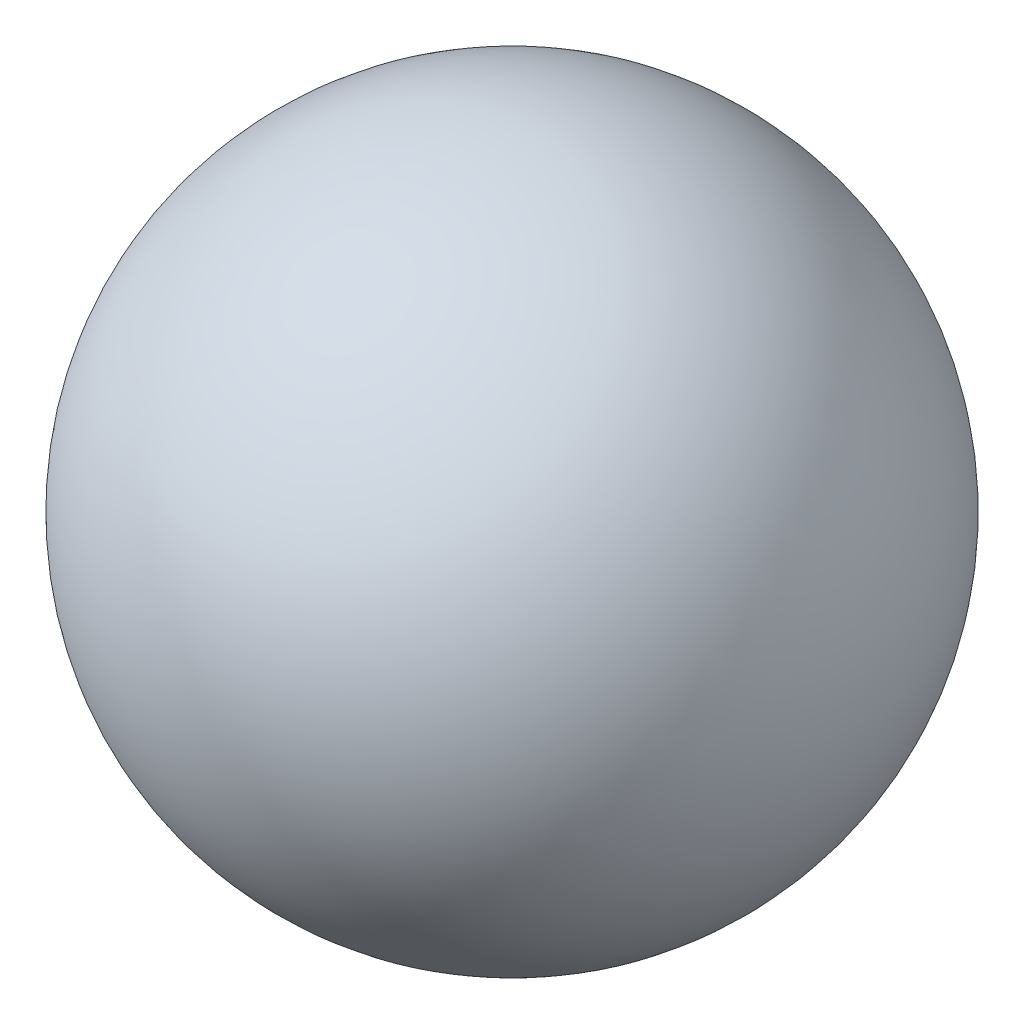
ISO-10303-21;
HEADER;
FILE_DESCRIPTION(('STEP AP214'),'2;1');
FILE_NAME('part.step','',(''),(''),'','','');
FILE_SCHEMA(('AUTOMOTIVE_DESIGN { 1 0 10303 214 1 1 1 1 }'));
ENDSEC;
DATA;
#1=APPLICATION_CONTEXT('core data for automotive mechanical design processes');
#2=APPLICATION_PROTOCOL_DEFINITION('international standard','automotive_design',2000,#1);
#3=PRODUCT_CONTEXT('',#1,'mechanical');
#4=PRODUCT('Part','Part','',(#3));
#5=PRODUCT_RELATED_PRODUCT_CATEGORY('part','',(#4));
#6=PRODUCT_DEFINITION_FORMATION('','',#4);
#7=PRODUCT_DEFINITION_CONTEXT('part definition',#1,'design');
#8=PRODUCT_DEFINITION('design','',#6,#7);
#9=PRODUCT_DEFINITION_SHAPE('','',#8);
#10=(LENGTH_UNIT() NAMED_UNIT(*) SI_UNIT(.MILLI.,.METRE.));
#11=(NAMED_UNIT(*) PLANE_ANGLE_UNIT() SI_UNIT($,.RADIAN.));
#12=(NAMED_UNIT(*) SI_UNIT($,.STERADIAN.) SOLID_ANGLE_UNIT());
#13=UNCERTAINTY_MEASURE_WITH_UNIT(LENGTH_MEASURE(1.E-05),#10,'distance_accuracy_value','');
#14=(GEOMETRIC_REPRESENTATION_CONTEXT(3) GLOBAL_UNCERTAINTY_ASSIGNED_CONTEXT((#13)) GLOBAL_UNIT_ASSIGNED_CONTEXT((#10,
#11,#12)) REPRESENTATION_CONTEXT('',''));
#15=CARTESIAN_POINT('',(0.,0.,0.));
#16=DIRECTION('',(0.,0.,1.));
#17=DIRECTION('',(1.,0.,0.));
#18=AXIS2_PLACEMENT_3D('',#15,#16,#17);
#19=CARTESIAN_POINT('',(0.,0.,0.));
#20=DIRECTION('',(0.,1.,0.));
#21=DIRECTION('',(1.,0.,0.));
#22=AXIS2_PLACEMENT_3D('',#19,#20,#21);
#23=SPHERICAL_SURFACE('',#22,8.5);
#24=CARTESIAN_POINT('',(0.,8.5,0.));
#25=VERTEX_POINT('',#24);
#26=VERTEX_LOOP('',#25);
#27=FACE_BOUND('',#26,.T.);
#28=ADVANCED_FACE('F30',(#27),#23,.T.);
#29=CLOSED_SHELL('',(#28));
#30=MANIFOLD_SOLID_BREP('B2',#29);
#31=ADVANCED_BREP_SHAPE_REPRESENTATION('',(#18,#30),#14);
#32=SHAPE_DEFINITION_REPRESENTATION(#9,#31);
ENDSEC;
END-ISO-10303-21;
